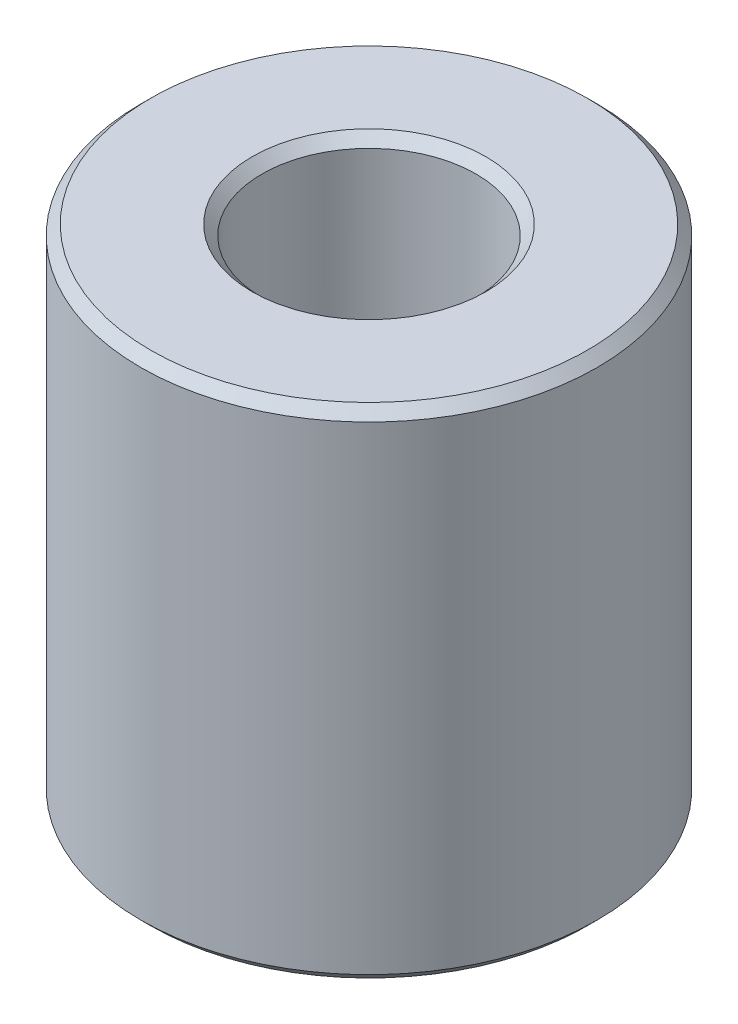
ISO-10303-21;
HEADER;
FILE_DESCRIPTION(('STEP AP214'),'2;1');
FILE_NAME('part.step','',(''),(''),'','','');
FILE_SCHEMA(('AUTOMOTIVE_DESIGN { 1 0 10303 214 1 1 1 1 }'));
ENDSEC;
DATA;
#1=APPLICATION_CONTEXT('core data for automotive mechanical design processes');
#2=APPLICATION_PROTOCOL_DEFINITION('international standard','automotive_design',2000,#1);
#3=PRODUCT_CONTEXT('',#1,'mechanical');
#4=PRODUCT('Part','Part','',(#3));
#5=PRODUCT_RELATED_PRODUCT_CATEGORY('part','',(#4));
#6=PRODUCT_DEFINITION_FORMATION('','',#4);
#7=PRODUCT_DEFINITION_CONTEXT('part definition',#1,'design');
#8=PRODUCT_DEFINITION('design','',#6,#7);
#9=PRODUCT_DEFINITION_SHAPE('','',#8);
#10=(LENGTH_UNIT() NAMED_UNIT(*) SI_UNIT(.MILLI.,.METRE.));
#11=(NAMED_UNIT(*) PLANE_ANGLE_UNIT() SI_UNIT($,.RADIAN.));
#12=(NAMED_UNIT(*) SI_UNIT($,.STERADIAN.) SOLID_ANGLE_UNIT());
#13=UNCERTAINTY_MEASURE_WITH_UNIT(LENGTH_MEASURE(1.E-05),#10,'distance_accuracy_value','');
#14=(GEOMETRIC_REPRESENTATION_CONTEXT(3) GLOBAL_UNCERTAINTY_ASSIGNED_CONTEXT((#13)) GLOBAL_UNIT_ASSIGNED_CONTEXT((#10,
#11,#12)) REPRESENTATION_CONTEXT('',''));
#15=CARTESIAN_POINT('',(0.,0.,0.));
#16=DIRECTION('',(0.,0.,1.));
#17=DIRECTION('',(1.,0.,0.));
#18=AXIS2_PLACEMENT_3D('',#15,#16,#17);
#19=CARTESIAN_POINT('',(0.,10.9186887231663,0.));
#20=DIRECTION('',(0.,-1.,0.));
#21=DIRECTION('',(0.,0.,-1.));
#22=AXIS2_PLACEMENT_3D('',#19,#20,#21);
#23=CYLINDRICAL_SURFACE('',#22,5.);
#24=CARTESIAN_POINT('',(0.,0.217821555991577,0.));
#25=DIRECTION('',(0.,1.,0.));
#26=DIRECTION('',(0.,0.,1.));
#27=AXIS2_PLACEMENT_3D('',#24,#25,#26);
#28=CIRCLE('',#27,5.);
#29=CARTESIAN_POINT('',(0.,0.217821555991577,5.));
#30=VERTEX_POINT('',#29);
#31=EDGE_CURVE('E10',#30,#30,#28,.T.);
#32=ORIENTED_EDGE('',*,*,#31,.T.);
#33=EDGE_LOOP('',(#32));
#34=FACE_BOUND('',#33,.T.);
#35=CARTESIAN_POINT('',(0.,10.7008671671747,0.));
#36=DIRECTION('',(0.,1.,0.));
#37=DIRECTION('',(0.,0.,1.));
#38=AXIS2_PLACEMENT_3D('',#35,#36,#37);
#39=CIRCLE('',#38,5.);
#40=CARTESIAN_POINT('',(0.,10.7008671671747,5.));
#41=VERTEX_POINT('',#40);
#42=EDGE_CURVE('E50',#41,#41,#39,.F.);
#43=ORIENTED_EDGE('',*,*,#42,.T.);
#44=EDGE_LOOP('',(#43));
#45=FACE_BOUND('',#44,.T.);
#46=ADVANCED_FACE('F39',(#34,#45),#23,.T.);
#47=CARTESIAN_POINT('',(0.,10.9186887231663,0.));
#48=DIRECTION('',(0.,1.,0.));
#49=DIRECTION('',(0.,0.,1.));
#50=AXIS2_PLACEMENT_3D('',#47,#48,#49);
#51=PLANE('',#50);
#52=CARTESIAN_POINT('',(0.,10.9186887231663,0.));
#53=DIRECTION('',(0.,1.,0.));
#54=DIRECTION('',(0.,0.,1.));
#55=AXIS2_PLACEMENT_3D('',#52,#53,#54);
#56=CIRCLE('',#55,2.56162376467788);
#57=CARTESIAN_POINT('',(0.,10.9186887231663,2.56162376467788));
#58=VERTEX_POINT('',#57);
#59=EDGE_CURVE('E58',#58,#58,#56,.F.);
#60=ORIENTED_EDGE('',*,*,#59,.T.);
#61=EDGE_LOOP('',(#60));
#62=FACE_BOUND('',#61,.T.);
#63=CARTESIAN_POINT('',(0.,10.9186887231663,0.));
#64=DIRECTION('',(0.,1.,0.));
#65=DIRECTION('',(0.,0.,1.));
#66=AXIS2_PLACEMENT_3D('',#63,#64,#65);
#67=CIRCLE('',#66,4.78217844400842);
#68=CARTESIAN_POINT('',(0.,10.9186887231663,4.78217844400842));
#69=VERTEX_POINT('',#68);
#70=EDGE_CURVE('E61',#69,#69,#67,.T.);
#71=ORIENTED_EDGE('',*,*,#70,.T.);
#72=EDGE_LOOP('',(#71));
#73=FACE_BOUND('',#72,.T.);
#74=ADVANCED_FACE('F88',(#62,#73),#51,.T.);
#75=CARTESIAN_POINT('',(0.,0.,0.));
#76=DIRECTION('',(0.,1.,0.));
#77=DIRECTION('',(0.,0.,1.));
#78=AXIS2_PLACEMENT_3D('',#75,#76,#77);
#79=PLANE('',#78);
#80=CARTESIAN_POINT('',(0.,0.,0.));
#81=DIRECTION('',(0.,1.,0.));
#82=DIRECTION('',(0.,0.,1.));
#83=AXIS2_PLACEMENT_3D('',#80,#81,#82);
#84=CIRCLE('',#83,2.56162376467788);
#85=CARTESIAN_POINT('',(0.,0.,-2.56162376467788));
#86=VERTEX_POINT('',#85);
#87=EDGE_CURVE('E51',#86,#86,#84,.T.);
#88=ORIENTED_EDGE('',*,*,#87,.T.);
#89=EDGE_LOOP('',(#88));
#90=FACE_BOUND('',#89,.T.);
#91=CARTESIAN_POINT('',(0.,0.,0.));
#92=DIRECTION('',(0.,1.,0.));
#93=DIRECTION('',(0.,0.,1.));
#94=AXIS2_PLACEMENT_3D('',#91,#92,#93);
#95=CIRCLE('',#94,4.78217844400842);
#96=CARTESIAN_POINT('',(0.,0.,4.78217844400842));
#97=VERTEX_POINT('',#96);
#98=EDGE_CURVE('E54',#97,#97,#95,.F.);
#99=ORIENTED_EDGE('',*,*,#98,.T.);
#100=EDGE_LOOP('',(#99));
#101=FACE_BOUND('',#100,.T.);
#102=ADVANCED_FACE('F83',(#90,#101),#79,.F.);
#103=CARTESIAN_POINT('',(0.,10.9186887231663,0.));
#104=DIRECTION('',(0.,-1.,0.));
#105=DIRECTION('',(0.,0.,-1.));
#106=AXIS2_PLACEMENT_3D('',#103,#104,#105);
#107=CYLINDRICAL_SURFACE('',#106,2.3438022086863);
#108=CARTESIAN_POINT('',(0.,10.7008671671747,0.));
#109=DIRECTION('',(0.,1.,0.));
#110=DIRECTION('',(0.,0.,1.));
#111=AXIS2_PLACEMENT_3D('',#108,#109,#110);
#112=CIRCLE('',#111,2.3438022086863);
#113=CARTESIAN_POINT('',(0.,10.7008671671747,2.3438022086863));
#114=VERTEX_POINT('',#113);
#115=EDGE_CURVE('E67',#114,#114,#112,.T.);
#116=ORIENTED_EDGE('',*,*,#115,.T.);
#117=EDGE_LOOP('',(#116));
#118=FACE_BOUND('',#117,.T.);
#119=CARTESIAN_POINT('',(0.,0.217821555991584,0.));
#120=DIRECTION('',(0.,1.,0.));
#121=DIRECTION('',(0.,0.,1.));
#122=AXIS2_PLACEMENT_3D('',#119,#120,#121);
#123=CIRCLE('',#122,2.3438022086863);
#124=CARTESIAN_POINT('',(0.,0.217821555991584,-2.3438022086863));
#125=VERTEX_POINT('',#124);
#126=EDGE_CURVE('E69',#125,#125,#123,.F.);
#127=ORIENTED_EDGE('',*,*,#126,.T.);
#128=EDGE_LOOP('',(#127));
#129=FACE_BOUND('',#128,.T.);
#130=ADVANCED_FACE('F71',(#118,#129),#107,.F.);
#131=CARTESIAN_POINT('',(0.,10.7008671671747,0.));
#132=DIRECTION('',(0.,1.,0.));
#133=DIRECTION('',(0.,0.,1.));
#134=AXIS2_PLACEMENT_3D('',#131,#132,#133);
#135=CONICAL_SURFACE('',#134,2.3438022086863,0.785398163397447);
#136=ORIENTED_EDGE('',*,*,#59,.F.);
#137=EDGE_LOOP('',(#136));
#138=FACE_BOUND('',#137,.T.);
#139=ORIENTED_EDGE('',*,*,#115,.F.);
#140=EDGE_LOOP('',(#139));
#141=FACE_BOUND('',#140,.T.);
#142=ADVANCED_FACE('F77',(#138,#141),#135,.F.);
#143=CARTESIAN_POINT('',(0.,0.,0.));
#144=DIRECTION('',(0.,-1.,0.));
#145=DIRECTION('',(0.,0.,-1.));
#146=AXIS2_PLACEMENT_3D('',#143,#144,#145);
#147=CONICAL_SURFACE('',#146,2.56162376467788,0.785398163397439);
#148=CARTESIAN_POINT('',(0.,0.217821555991584,-2.3438022086863));
#149=CARTESIAN_POINT('',(0.,0.215552581450005,-2.34607118322788));
#150=CARTESIAN_POINT('',(0.,0.213283606908426,-2.34834015776946));
#151=CARTESIAN_POINT('',(0.,0.208745657825268,-2.35287810685262));
#152=CARTESIAN_POINT('',(0.,0.206476683283689,-2.3551470813942));
#153=CARTESIAN_POINT('',(0.,0.201938734200531,-2.35968503047736));
#154=CARTESIAN_POINT('',(0.,0.199669759658952,-2.36195400501894));
#155=CARTESIAN_POINT('',(0.,0.195131810575794,-2.36649195410209));
#156=CARTESIAN_POINT('',(0.,0.192862836034215,-2.36876092864367));
#157=CARTESIAN_POINT('',(0.,0.188324886951057,-2.37329887772683));
#158=CARTESIAN_POINT('',(0.,0.186055912409478,-2.37556785226841));
#159=CARTESIAN_POINT('',(0.,0.18151796332632,-2.38010580135157));
#160=CARTESIAN_POINT('',(0.,0.179248988784741,-2.38237477589315));
#161=CARTESIAN_POINT('',(0.,0.174711039701583,-2.3869127249763));
#162=CARTESIAN_POINT('',(0.,0.172442065160004,-2.38918169951788));
#163=CARTESIAN_POINT('',(0.,0.167904116076846,-2.39371964860104));
#164=CARTESIAN_POINT('',(0.,0.165635141535267,-2.39598862314262));
#165=CARTESIAN_POINT('',(0.,0.161097192452109,-2.40052657222578));
#166=CARTESIAN_POINT('',(0.,0.15882821791053,-2.40279554676736));
#167=CARTESIAN_POINT('',(0.,0.154290268827372,-2.40733349585051));
#168=CARTESIAN_POINT('',(0.,0.152021294285793,-2.40960247039209));
#169=CARTESIAN_POINT('',(0.,0.147483345202635,-2.41414041947525));
#170=CARTESIAN_POINT('',(0.,0.145214370661056,-2.41640939401683));
#171=CARTESIAN_POINT('',(0.,0.140676421577898,-2.42094734309999));
#172=CARTESIAN_POINT('',(0.,0.138407447036319,-2.42321631764157));
#173=CARTESIAN_POINT('',(0.,0.133869497953161,-2.42775426672473));
#174=CARTESIAN_POINT('',(0.,0.131600523411582,-2.4300232412663));
#175=CARTESIAN_POINT('',(0.,0.127062574328424,-2.43456119034946));
#176=CARTESIAN_POINT('',(0.,0.124793599786845,-2.43683016489104));
#177=CARTESIAN_POINT('',(0.,0.120255650703687,-2.4413681139742));
#178=CARTESIAN_POINT('',(0.,0.117986676162108,-2.44363708851578));
#179=CARTESIAN_POINT('',(0.,0.11344872707895,-2.44817503759894));
#180=CARTESIAN_POINT('',(0.,0.111179752537371,-2.45044401214051));
#181=CARTESIAN_POINT('',(0.,0.106641803454213,-2.45498196122367));
#182=CARTESIAN_POINT('',(0.,0.104372828912634,-2.45725093576525));
#183=CARTESIAN_POINT('',(0.,0.0998348798294762,-2.46178888484841));
#184=CARTESIAN_POINT('',(0.,0.0975659052878972,-2.46405785938999));
#185=CARTESIAN_POINT('',(0.,0.0930279562047391,-2.46859580847315));
#186=CARTESIAN_POINT('',(0.,0.0907589816631601,-2.47086478301473));
#187=CARTESIAN_POINT('',(0.,0.0862210325800021,-2.47540273209788));
#188=CARTESIAN_POINT('',(0.,0.0839520580384231,-2.47767170663946));
#189=CARTESIAN_POINT('',(0.,0.0794141089552651,-2.48220965572262));
#190=CARTESIAN_POINT('',(0.,0.0771451344136861,-2.4844786302642));
#191=CARTESIAN_POINT('',(0.,0.0726071853305281,-2.48901657934736));
#192=CARTESIAN_POINT('',(0.,0.0703382107889491,-2.49128555388894));
#193=CARTESIAN_POINT('',(0.,0.0658002617057911,-2.49582350297209));
#194=CARTESIAN_POINT('',(0.,0.0635312871642121,-2.49809247751367));
#195=CARTESIAN_POINT('',(0.,0.0589933380810541,-2.50263042659683));
#196=CARTESIAN_POINT('',(0.,0.0567243635394751,-2.50489940113841));
#197=CARTESIAN_POINT('',(0.,0.0521864144563171,-2.50943735022157));
#198=CARTESIAN_POINT('',(0.,0.0499174399147381,-2.51170632476315));
#199=CARTESIAN_POINT('',(0.,0.0453794908315801,-2.51624427384631));
#200=CARTESIAN_POINT('',(0.,0.043110516290001,-2.51851324838788));
#201=CARTESIAN_POINT('',(0.,0.038572567206843,-2.52305119747104));
#202=CARTESIAN_POINT('',(0.,0.0363035926652641,-2.52532017201262));
#203=CARTESIAN_POINT('',(0.,0.0317656435821061,-2.52985812109578));
#204=CARTESIAN_POINT('',(0.,0.0294966690405271,-2.53212709563736));
#205=CARTESIAN_POINT('',(0.,0.024958719957369,-2.53666504472052));
#206=CARTESIAN_POINT('',(0.,0.02268974541579,-2.53893401926209));
#207=CARTESIAN_POINT('',(0.,0.018151796332632,-2.54347196834525));
#208=CARTESIAN_POINT('',(0.,0.015882821791053,-2.54574094288683));
#209=CARTESIAN_POINT('',(0.,0.011344872707895,-2.55027889196999));
#210=CARTESIAN_POINT('',(0.,0.00907589816631601,-2.55254786651157));
#211=CARTESIAN_POINT('',(0.,0.00453794908315801,-2.55708581559473));
#212=CARTESIAN_POINT('',(0.,0.002268974541579,-2.55935479013631));
#213=CARTESIAN_POINT('',(0.,0.,-2.56162376467788));
#214=B_SPLINE_CURVE_WITH_KNOTS('',3,(#148,#149,#150,#151,#152,#153,#154,#155,#156,#157,#158,
#159,#160,#161,#162,#163,#164,#165,#166,#167,#168,#169,#170,#171,#172,#173,#174,#175,#176,#177,
#178,#179,#180,#181,#182,#183,#184,#185,#186,#187,#188,#189,#190,#191,#192,#193,#194,#195,#196,
#197,#198,#199,#200,#201,#202,#203,#204,#205,#206,#207,#208,#209,#210,#211,#212,#213),
.UNSPECIFIED.,.F.,.F.,(4,2,2,2,2,2,2,2,2,2,2,2,2,2,2,2,2,2,2,2,2,2,2,2,2,2,2,2,2,2,2,2,4),(0.,
0.00962644370814079,0.0192528874162816,0.0288793311244224,0.0385057748325632,0.048132218540704,
0.0577586622488451,0.0673851059569859,0.0770115496651267,0.0866379933732675,0.0962644370814082,
0.105890880789549,0.11551732449769,0.125143768205831,0.134770211913971,0.144396655622112,
0.154023099330253,0.163649543038394,0.173275986746535,0.182902430454676,0.192528874162817,
0.202155317870957,0.211781761579098,0.221408205287239,0.23103464899538,0.240661092703521,
0.250287536411661,0.259913980119802,0.269540423827943,0.279166867536084,0.288793311244225,
0.298419754952366,0.308046198660506),.UNSPECIFIED.);
#215=EDGE_CURVE('BSEAM73',#125,#86,#214,.T.);
#216=ORIENTED_EDGE('',*,*,#126,.F.);
#217=ORIENTED_EDGE('',*,*,#87,.F.);
#218=ORIENTED_EDGE('',*,*,#215,.T.);
#219=ORIENTED_EDGE('',*,*,#215,.F.);
#220=EDGE_LOOP('',(#216,#218,#217,#219));
#221=FACE_BOUND('',#220,.T.);
#222=ADVANCED_FACE('F73',(#221),#147,.F.);
#223=CARTESIAN_POINT('',(0.,0.217821555991577,0.));
#224=DIRECTION('',(0.,1.,0.));
#225=DIRECTION('',(0.,0.,1.));
#226=AXIS2_PLACEMENT_3D('',#223,#224,#225);
#227=CONICAL_SURFACE('',#226,5.,0.78539816339745);
#228=ORIENTED_EDGE('',*,*,#98,.F.);
#229=EDGE_LOOP('',(#228));
#230=FACE_BOUND('',#229,.T.);
#231=ORIENTED_EDGE('',*,*,#31,.F.);
#232=EDGE_LOOP('',(#231));
#233=FACE_BOUND('',#232,.T.);
#234=ADVANCED_FACE('F76',(#230,#233),#227,.T.);
#235=CARTESIAN_POINT('',(0.,10.9186887231663,0.));
#236=DIRECTION('',(0.,-1.,0.));
#237=DIRECTION('',(0.,0.,-1.));
#238=AXIS2_PLACEMENT_3D('',#235,#236,#237);
#239=CONICAL_SURFACE('',#238,4.78217844400842,0.785398163397438);
#240=ORIENTED_EDGE('',*,*,#42,.F.);
#241=EDGE_LOOP('',(#240));
#242=FACE_BOUND('',#241,.T.);
#243=ORIENTED_EDGE('',*,*,#70,.F.);
#244=EDGE_LOOP('',(#243));
#245=FACE_BOUND('',#244,.T.);
#246=ADVANCED_FACE('F45',(#242,#245),#239,.T.);
#247=CLOSED_SHELL('',(#46,#74,#102,#130,#142,#222,#234,#246));
#248=MANIFOLD_SOLID_BREP('B2',#247);
#249=ADVANCED_BREP_SHAPE_REPRESENTATION('',(#18,#248),#14);
#250=SHAPE_DEFINITION_REPRESENTATION(#9,#249);
ENDSEC;
END-ISO-10303-21;
